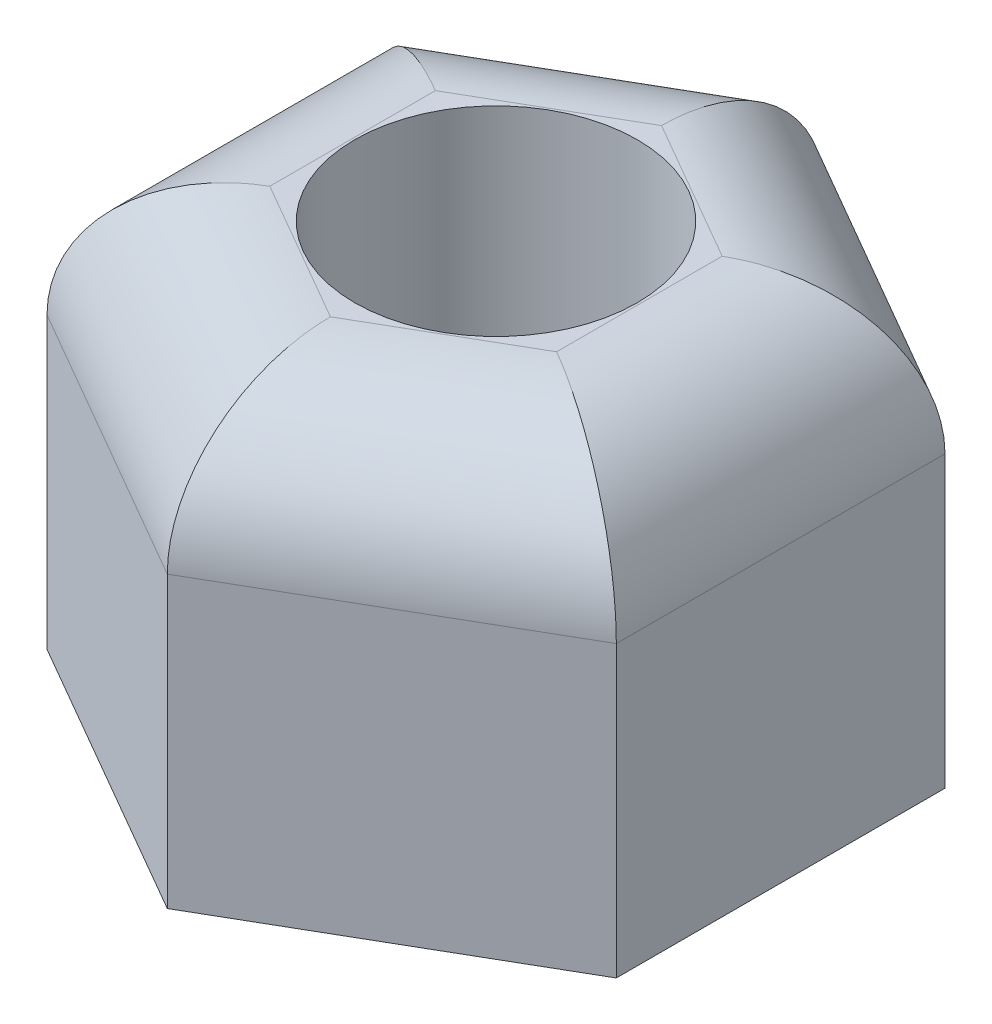
ISO-10303-21;
HEADER;
FILE_DESCRIPTION(('STEP AP214'),'2;1');
FILE_NAME('part.step','',(''),(''),'','','');
FILE_SCHEMA(('AUTOMOTIVE_DESIGN { 1 0 10303 214 1 1 1 1 }'));
ENDSEC;
DATA;
#1=APPLICATION_CONTEXT('core data for automotive mechanical design processes');
#2=APPLICATION_PROTOCOL_DEFINITION('international standard','automotive_design',2000,#1);
#3=PRODUCT_CONTEXT('',#1,'mechanical');
#4=PRODUCT('Part','Part','',(#3));
#5=PRODUCT_RELATED_PRODUCT_CATEGORY('part','',(#4));
#6=PRODUCT_DEFINITION_FORMATION('','',#4);
#7=PRODUCT_DEFINITION_CONTEXT('part definition',#1,'design');
#8=PRODUCT_DEFINITION('design','',#6,#7);
#9=PRODUCT_DEFINITION_SHAPE('','',#8);
#10=(LENGTH_UNIT() NAMED_UNIT(*) SI_UNIT(.MILLI.,.METRE.));
#11=(NAMED_UNIT(*) PLANE_ANGLE_UNIT() SI_UNIT($,.RADIAN.));
#12=(NAMED_UNIT(*) SI_UNIT($,.STERADIAN.) SOLID_ANGLE_UNIT());
#13=UNCERTAINTY_MEASURE_WITH_UNIT(LENGTH_MEASURE(1.E-05),#10,'distance_accuracy_value','');
#14=(GEOMETRIC_REPRESENTATION_CONTEXT(3) GLOBAL_UNCERTAINTY_ASSIGNED_CONTEXT((#13)) GLOBAL_UNIT_ASSIGNED_CONTEXT((#10,
#11,#12)) REPRESENTATION_CONTEXT('',''));
#15=CARTESIAN_POINT('',(0.,0.,0.));
#16=DIRECTION('',(0.,0.,1.));
#17=DIRECTION('',(1.,0.,0.));
#18=AXIS2_PLACEMENT_3D('',#15,#16,#17);
#19=CARTESIAN_POINT('',(0.,3.05,0.));
#20=DIRECTION('',(0.,1.,0.));
#21=DIRECTION('',(0.,0.,1.));
#22=AXIS2_PLACEMENT_3D('',#19,#20,#21);
#23=PLANE('',#22);
#24=DIRECTION('',(-0.866025403784438,0.,0.5));
#25=VECTOR('',#24,1.);
#26=CARTESIAN_POINT('',(-1.515,3.05,-0.297335388632656));
#27=LINE('',#26,#25);
#28=CARTESIAN_POINT('',(0.,3.05,-1.17202104645494));
#29=VERTEX_POINT('',#28);
#30=CARTESIAN_POINT('',(-1.015,3.05,-0.586010523227469));
#31=VERTEX_POINT('',#30);
#32=EDGE_CURVE('E159',#29,#31,#27,.T.);
#33=ORIENTED_EDGE('',*,*,#32,.T.);
#34=DIRECTION('',(0.,0.,1.));
#35=VECTOR('',#34,1.);
#36=CARTESIAN_POINT('',(-1.015,3.05,1.1633607924171));
#37=LINE('',#36,#35);
#38=CARTESIAN_POINT('',(-1.015,3.05,0.586010523227471));
#39=VERTEX_POINT('',#38);
#40=EDGE_CURVE('E161',#31,#39,#37,.T.);
#41=ORIENTED_EDGE('',*,*,#40,.T.);
#42=DIRECTION('',(0.866025403784439,0.,0.5));
#43=VECTOR('',#42,1.);
#44=CARTESIAN_POINT('',(0.500000000000001,3.05,1.46069618104975));
#45=LINE('',#44,#43);
#46=CARTESIAN_POINT('',(0.,3.05,1.17202104645494));
#47=VERTEX_POINT('',#46);
#48=EDGE_CURVE('E112',#39,#47,#45,.T.);
#49=ORIENTED_EDGE('',*,*,#48,.T.);
#50=DIRECTION('',(0.866025403784439,0.,-0.5));
#51=VECTOR('',#50,1.);
#52=CARTESIAN_POINT('',(1.515,3.05,0.297335388632656));
#53=LINE('',#52,#51);
#54=CARTESIAN_POINT('',(1.015,3.05,0.586010523227469));
#55=VERTEX_POINT('',#54);
#56=EDGE_CURVE('E153',#47,#55,#53,.T.);
#57=ORIENTED_EDGE('',*,*,#56,.T.);
#58=DIRECTION('',(0.,0.,-1.));
#59=VECTOR('',#58,1.);
#60=CARTESIAN_POINT('',(1.015,3.05,-1.1633607924171));
#61=LINE('',#60,#59);
#62=CARTESIAN_POINT('',(1.015,3.05,-0.58601052322747));
#63=VERTEX_POINT('',#62);
#64=EDGE_CURVE('E155',#55,#63,#61,.T.);
#65=ORIENTED_EDGE('',*,*,#64,.T.);
#66=DIRECTION('',(-0.866025403784439,0.,-0.5));
#67=VECTOR('',#66,1.);
#68=CARTESIAN_POINT('',(-0.5,3.05,-1.46069618104975));
#69=LINE('',#68,#67);
#70=EDGE_CURVE('E157',#63,#29,#69,.T.);
#71=ORIENTED_EDGE('',*,*,#70,.T.);
#72=EDGE_LOOP('',(#33,#41,#49,#57,#65,#71));
#73=FACE_BOUND('',#72,.T.);
#74=CARTESIAN_POINT('',(0.,3.05,0.));
#75=DIRECTION('',(0.,1.,0.));
#76=DIRECTION('',(0.,0.,1.));
#77=AXIS2_PLACEMENT_3D('',#74,#75,#76);
#78=CIRCLE('',#77,1.);
#79=CARTESIAN_POINT('',(0.,3.05,1.));
#80=VERTEX_POINT('',#79);
#81=EDGE_CURVE('E128',#80,#80,#78,.T.);
#82=ORIENTED_EDGE('',*,*,#81,.F.);
#83=EDGE_LOOP('',(#82));
#84=FACE_BOUND('',#83,.T.);
#85=ADVANCED_FACE('F32',(#73,#84),#23,.T.);
#86=CARTESIAN_POINT('',(0.,0.,0.));
#87=DIRECTION('',(0.,1.,0.));
#88=DIRECTION('',(0.,0.,1.));
#89=AXIS2_PLACEMENT_3D('',#86,#87,#88);
#90=PLANE('',#89);
#91=DIRECTION('',(0.,0.,-1.));
#92=VECTOR('',#91,1.);
#93=CARTESIAN_POINT('',(2.015,0.,1.16336079241709));
#94=LINE('',#93,#92);
#95=CARTESIAN_POINT('',(2.015,0.,1.16336079241709));
#96=VERTEX_POINT('',#95);
#97=CARTESIAN_POINT('',(2.015,0.,-1.1633607924171));
#98=VERTEX_POINT('',#97);
#99=EDGE_CURVE('E120',#96,#98,#94,.T.);
#100=ORIENTED_EDGE('',*,*,#99,.F.);
#101=DIRECTION('',(0.866025403784438,0.,-0.5));
#102=VECTOR('',#101,1.);
#103=CARTESIAN_POINT('',(0.,0.,2.32672158483419));
#104=LINE('',#103,#102);
#105=CARTESIAN_POINT('',(0.,0.,2.32672158483419));
#106=VERTEX_POINT('',#105);
#107=EDGE_CURVE('E142',#106,#96,#104,.T.);
#108=ORIENTED_EDGE('',*,*,#107,.F.);
#109=DIRECTION('',(0.866025403784439,0.,0.5));
#110=VECTOR('',#109,1.);
#111=CARTESIAN_POINT('',(-2.015,0.,1.1633607924171));
#112=LINE('',#111,#110);
#113=CARTESIAN_POINT('',(-2.015,0.,1.1633607924171));
#114=VERTEX_POINT('',#113);
#115=EDGE_CURVE('E139',#114,#106,#112,.T.);
#116=ORIENTED_EDGE('',*,*,#115,.F.);
#117=DIRECTION('',(0.,0.,1.));
#118=VECTOR('',#117,1.);
#119=CARTESIAN_POINT('',(-2.015,0.,-1.1633607924171));
#120=LINE('',#119,#118);
#121=CARTESIAN_POINT('',(-2.015,0.,-1.1633607924171));
#122=VERTEX_POINT('',#121);
#123=EDGE_CURVE('E136',#122,#114,#120,.T.);
#124=ORIENTED_EDGE('',*,*,#123,.F.);
#125=DIRECTION('',(-0.866025403784438,0.,0.5));
#126=VECTOR('',#125,1.);
#127=CARTESIAN_POINT('',(0.,0.,-2.32672158483419));
#128=LINE('',#127,#126);
#129=CARTESIAN_POINT('',(0.,0.,-2.32672158483419));
#130=VERTEX_POINT('',#129);
#131=EDGE_CURVE('E123',#130,#122,#128,.T.);
#132=ORIENTED_EDGE('',*,*,#131,.F.);
#133=DIRECTION('',(-0.866025403784439,0.,-0.5));
#134=VECTOR('',#133,1.);
#135=CARTESIAN_POINT('',(2.015,0.,-1.1633607924171));
#136=LINE('',#135,#134);
#137=EDGE_CURVE('E107',#98,#130,#136,.T.);
#138=ORIENTED_EDGE('',*,*,#137,.F.);
#139=EDGE_LOOP('',(#100,#108,#116,#124,#132,#138));
#140=FACE_BOUND('',#139,.T.);
#141=CARTESIAN_POINT('',(0.,0.,0.));
#142=DIRECTION('',(0.,1.,0.));
#143=DIRECTION('',(0.,0.,1.));
#144=AXIS2_PLACEMENT_3D('',#141,#142,#143);
#145=CIRCLE('',#144,1.);
#146=CARTESIAN_POINT('',(0.,0.,1.));
#147=VERTEX_POINT('',#146);
#148=EDGE_CURVE('E131',#147,#147,#145,.T.);
#149=ORIENTED_EDGE('',*,*,#148,.T.);
#150=EDGE_LOOP('',(#149));
#151=FACE_BOUND('',#150,.T.);
#152=ADVANCED_FACE('F117',(#140,#151),#90,.F.);
#153=CARTESIAN_POINT('',(2.015,3.05,1.16336079241709));
#154=DIRECTION('',(-1.,0.,0.));
#155=DIRECTION('',(0.,0.,1.));
#156=AXIS2_PLACEMENT_3D('',#153,#154,#155);
#157=PLANE('',#156);
#158=DIRECTION('',(0.,-1.,0.));
#159=VECTOR('',#158,1.);
#160=CARTESIAN_POINT('',(2.015,3.05,-1.1633607924171));
#161=LINE('',#160,#159);
#162=CARTESIAN_POINT('',(2.015,2.05,-1.1633607924171));
#163=VERTEX_POINT('',#162);
#164=EDGE_CURVE('E103',#163,#98,#161,.T.);
#165=ORIENTED_EDGE('',*,*,#164,.F.);
#166=DIRECTION('',(0.,0.,-1.));
#167=VECTOR('',#166,1.);
#168=CARTESIAN_POINT('',(2.015,2.05,1.16336079241709));
#169=LINE('',#168,#167);
#170=CARTESIAN_POINT('',(2.015,2.05,1.16336079241709));
#171=VERTEX_POINT('',#170);
#172=EDGE_CURVE('E56',#163,#171,#169,.F.);
#173=ORIENTED_EDGE('',*,*,#172,.T.);
#174=DIRECTION('',(0.,-1.,0.));
#175=VECTOR('',#174,1.);
#176=CARTESIAN_POINT('',(2.015,3.05,1.16336079241709));
#177=LINE('',#176,#175);
#178=EDGE_CURVE('E126',#171,#96,#177,.T.);
#179=ORIENTED_EDGE('',*,*,#178,.T.);
#180=ORIENTED_EDGE('',*,*,#99,.T.);
#181=EDGE_LOOP('',(#165,#173,#179,#180));
#182=FACE_BOUND('',#181,.T.);
#183=ADVANCED_FACE('F125',(#182),#157,.F.);
#184=CARTESIAN_POINT('',(2.015,3.05,-1.1633607924171));
#185=DIRECTION('',(-0.5,0.,0.866025403784439));
#186=DIRECTION('',(0.866025403784439,0.,0.5));
#187=AXIS2_PLACEMENT_3D('',#184,#185,#186);
#188=PLANE('',#187);
#189=DIRECTION('',(0.,-1.,0.));
#190=VECTOR('',#189,1.);
#191=CARTESIAN_POINT('',(0.,3.05,-2.32672158483419));
#192=LINE('',#191,#190);
#193=CARTESIAN_POINT('',(0.,2.05,-2.32672158483419));
#194=VERTEX_POINT('',#193);
#195=EDGE_CURVE('E113',#194,#130,#192,.T.);
#196=ORIENTED_EDGE('',*,*,#195,.F.);
#197=DIRECTION('',(-0.866025403784439,0.,-0.5));
#198=VECTOR('',#197,1.);
#199=CARTESIAN_POINT('',(2.015,2.05,-1.1633607924171));
#200=LINE('',#199,#198);
#201=EDGE_CURVE('E110',#194,#163,#200,.F.);
#202=ORIENTED_EDGE('',*,*,#201,.T.);
#203=ORIENTED_EDGE('',*,*,#164,.T.);
#204=ORIENTED_EDGE('',*,*,#137,.T.);
#205=EDGE_LOOP('',(#196,#202,#203,#204));
#206=FACE_BOUND('',#205,.T.);
#207=ADVANCED_FACE('F106',(#206),#188,.F.);
#208=CARTESIAN_POINT('',(0.,3.05,-2.32672158483419));
#209=DIRECTION('',(0.5,0.,0.866025403784438));
#210=DIRECTION('',(0.866025403784438,0.,-0.5));
#211=AXIS2_PLACEMENT_3D('',#208,#209,#210);
#212=PLANE('',#211);
#213=DIRECTION('',(0.,-1.,0.));
#214=VECTOR('',#213,1.);
#215=CARTESIAN_POINT('',(-2.015,3.05,-1.1633607924171));
#216=LINE('',#215,#214);
#217=CARTESIAN_POINT('',(-2.015,2.05,-1.1633607924171));
#218=VERTEX_POINT('',#217);
#219=EDGE_CURVE('E149',#218,#122,#216,.T.);
#220=ORIENTED_EDGE('',*,*,#219,.F.);
#221=DIRECTION('',(-0.866025403784438,0.,0.5));
#222=VECTOR('',#221,1.);
#223=CARTESIAN_POINT('',(0.,2.05,-2.32672158483419));
#224=LINE('',#223,#222);
#225=EDGE_CURVE('E167',#218,#194,#224,.F.);
#226=ORIENTED_EDGE('',*,*,#225,.T.);
#227=ORIENTED_EDGE('',*,*,#195,.T.);
#228=ORIENTED_EDGE('',*,*,#131,.T.);
#229=EDGE_LOOP('',(#220,#226,#227,#228));
#230=FACE_BOUND('',#229,.T.);
#231=ADVANCED_FACE('F221',(#230),#212,.F.);
#232=CARTESIAN_POINT('',(-2.015,3.05,-1.1633607924171));
#233=DIRECTION('',(1.,0.,0.));
#234=DIRECTION('',(0.,0.,-1.));
#235=AXIS2_PLACEMENT_3D('',#232,#233,#234);
#236=PLANE('',#235);
#237=DIRECTION('',(0.,-1.,0.));
#238=VECTOR('',#237,1.);
#239=CARTESIAN_POINT('',(-2.015,3.05,1.1633607924171));
#240=LINE('',#239,#238);
#241=CARTESIAN_POINT('',(-2.015,2.05,1.1633607924171));
#242=VERTEX_POINT('',#241);
#243=EDGE_CURVE('E147',#242,#114,#240,.T.);
#244=ORIENTED_EDGE('',*,*,#243,.F.);
#245=DIRECTION('',(0.,0.,1.));
#246=VECTOR('',#245,1.);
#247=CARTESIAN_POINT('',(-2.015,2.05,-1.1633607924171));
#248=LINE('',#247,#246);
#249=EDGE_CURVE('E164',#242,#218,#248,.F.);
#250=ORIENTED_EDGE('',*,*,#249,.T.);
#251=ORIENTED_EDGE('',*,*,#219,.T.);
#252=ORIENTED_EDGE('',*,*,#123,.T.);
#253=EDGE_LOOP('',(#244,#250,#251,#252));
#254=FACE_BOUND('',#253,.T.);
#255=ADVANCED_FACE('F217',(#254),#236,.F.);
#256=CARTESIAN_POINT('',(-2.015,3.05,1.1633607924171));
#257=DIRECTION('',(0.5,0.,-0.866025403784439));
#258=DIRECTION('',(-0.866025403784439,0.,-0.5));
#259=AXIS2_PLACEMENT_3D('',#256,#257,#258);
#260=PLANE('',#259);
#261=DIRECTION('',(0.,-1.,0.));
#262=VECTOR('',#261,1.);
#263=CARTESIAN_POINT('',(0.,3.05,2.32672158483419));
#264=LINE('',#263,#262);
#265=CARTESIAN_POINT('',(0.,2.05,2.32672158483419));
#266=VERTEX_POINT('',#265);
#267=EDGE_CURVE('E145',#266,#106,#264,.T.);
#268=ORIENTED_EDGE('',*,*,#267,.F.);
#269=DIRECTION('',(0.866025403784439,0.,0.5));
#270=VECTOR('',#269,1.);
#271=CARTESIAN_POINT('',(-2.015,2.05,1.1633607924171));
#272=LINE('',#271,#270);
#273=EDGE_CURVE('E11',#266,#242,#272,.F.);
#274=ORIENTED_EDGE('',*,*,#273,.T.);
#275=ORIENTED_EDGE('',*,*,#243,.T.);
#276=ORIENTED_EDGE('',*,*,#115,.T.);
#277=EDGE_LOOP('',(#268,#274,#275,#276));
#278=FACE_BOUND('',#277,.T.);
#279=ADVANCED_FACE('F204',(#278),#260,.F.);
#280=CARTESIAN_POINT('',(0.,3.05,2.32672158483419));
#281=DIRECTION('',(-0.5,0.,-0.866025403784439));
#282=DIRECTION('',(-0.866025403784439,0.,0.5));
#283=AXIS2_PLACEMENT_3D('',#280,#281,#282);
#284=PLANE('',#283);
#285=ORIENTED_EDGE('',*,*,#178,.F.);
#286=DIRECTION('',(0.866025403784439,0.,-0.5));
#287=VECTOR('',#286,1.);
#288=CARTESIAN_POINT('',(0.,2.05,2.32672158483419));
#289=LINE('',#288,#287);
#290=EDGE_CURVE('E41',#171,#266,#289,.F.);
#291=ORIENTED_EDGE('',*,*,#290,.T.);
#292=ORIENTED_EDGE('',*,*,#267,.T.);
#293=ORIENTED_EDGE('',*,*,#107,.T.);
#294=EDGE_LOOP('',(#285,#291,#292,#293));
#295=FACE_BOUND('',#294,.T.);
#296=ADVANCED_FACE('F195',(#295),#284,.F.);
#297=CARTESIAN_POINT('',(0.,3.05,0.));
#298=DIRECTION('',(0.,-1.,0.));
#299=DIRECTION('',(0.,0.,-1.));
#300=AXIS2_PLACEMENT_3D('',#297,#298,#299);
#301=CYLINDRICAL_SURFACE('',#300,1.);
#302=ORIENTED_EDGE('',*,*,#81,.T.);
#303=EDGE_LOOP('',(#302));
#304=FACE_BOUND('',#303,.T.);
#305=ORIENTED_EDGE('',*,*,#148,.F.);
#306=EDGE_LOOP('',(#305));
#307=FACE_BOUND('',#306,.T.);
#308=ADVANCED_FACE('F193',(#304,#307),#301,.F.);
#309=CARTESIAN_POINT('',(1.015,2.05,0.));
#310=DIRECTION('',(0.,0.,1.));
#311=DIRECTION('',(1.,0.,0.));
#312=AXIS2_PLACEMENT_3D('',#309,#310,#311);
#313=CYLINDRICAL_SURFACE('',#312,1.);
#314=CARTESIAN_POINT('',(1.015,2.05,0.586010523227469));
#315=DIRECTION('',(-0.5,0.,0.866025403784439));
#316=DIRECTION('',(-0.866025403784439,0.,-0.5));
#317=AXIS2_PLACEMENT_3D('',#314,#315,#316);
#318=ELLIPSE('',#317,1.15470053837925,1.);
#319=EDGE_CURVE('E181',#171,#55,#318,.T.);
#320=ORIENTED_EDGE('',*,*,#319,.F.);
#321=ORIENTED_EDGE('',*,*,#172,.F.);
#322=CARTESIAN_POINT('',(1.015,2.05,-0.58601052322747));
#323=DIRECTION('',(0.5,0.,0.866025403784438));
#324=DIRECTION('',(-0.866025403784439,0.,0.5));
#325=AXIS2_PLACEMENT_3D('',#322,#323,#324);
#326=ELLIPSE('',#325,1.15470053837925,1.);
#327=EDGE_CURVE('E36',#63,#163,#326,.F.);
#328=ORIENTED_EDGE('',*,*,#327,.F.);
#329=ORIENTED_EDGE('',*,*,#64,.F.);
#330=EDGE_LOOP('',(#320,#321,#328,#329));
#331=FACE_BOUND('',#330,.T.);
#332=ADVANCED_FACE('F34',(#331),#313,.T.);
#333=CARTESIAN_POINT('',(0.5075,2.05,-0.879015784841205));
#334=DIRECTION('',(0.866025403784439,0.,0.5));
#335=DIRECTION('',(0.5,0.,-0.866025403784439));
#336=AXIS2_PLACEMENT_3D('',#333,#334,#335);
#337=CYLINDRICAL_SURFACE('',#336,1.);
#338=ORIENTED_EDGE('',*,*,#327,.T.);
#339=ORIENTED_EDGE('',*,*,#201,.F.);
#340=CARTESIAN_POINT('',(0.,2.05,-1.17202104645494));
#341=DIRECTION('',(1.,0.,0.));
#342=DIRECTION('',(0.,0.,1.));
#343=AXIS2_PLACEMENT_3D('',#340,#341,#342);
#344=ELLIPSE('',#343,1.15470053837925,1.);
#345=EDGE_CURVE('E179',#29,#194,#344,.F.);
#346=ORIENTED_EDGE('',*,*,#345,.F.);
#347=ORIENTED_EDGE('',*,*,#70,.F.);
#348=EDGE_LOOP('',(#338,#339,#346,#347));
#349=FACE_BOUND('',#348,.T.);
#350=ADVANCED_FACE('F202',(#349),#337,.T.);
#351=CARTESIAN_POINT('',(0.5075,2.05,0.879015784841205));
#352=DIRECTION('',(-0.866025403784439,0.,0.5));
#353=DIRECTION('',(0.5,0.,0.866025403784439));
#354=AXIS2_PLACEMENT_3D('',#351,#352,#353);
#355=CYLINDRICAL_SURFACE('',#354,1.);
#356=ORIENTED_EDGE('',*,*,#319,.T.);
#357=ORIENTED_EDGE('',*,*,#56,.F.);
#358=CARTESIAN_POINT('',(0.,2.05,1.17202104645494));
#359=DIRECTION('',(-1.,0.,0.));
#360=DIRECTION('',(0.,0.,-1.));
#361=AXIS2_PLACEMENT_3D('',#358,#359,#360);
#362=ELLIPSE('',#361,1.15470053837925,1.);
#363=EDGE_CURVE('E176',#266,#47,#362,.T.);
#364=ORIENTED_EDGE('',*,*,#363,.F.);
#365=ORIENTED_EDGE('',*,*,#290,.F.);
#366=EDGE_LOOP('',(#356,#357,#364,#365));
#367=FACE_BOUND('',#366,.T.);
#368=ADVANCED_FACE('F241',(#367),#355,.T.);
#369=CARTESIAN_POINT('',(-0.5075,2.05,-0.879015784841205));
#370=DIRECTION('',(0.866025403784438,0.,-0.5));
#371=DIRECTION('',(-0.5,0.,-0.866025403784438));
#372=AXIS2_PLACEMENT_3D('',#369,#370,#371);
#373=CYLINDRICAL_SURFACE('',#372,1.);
#374=ORIENTED_EDGE('',*,*,#345,.T.);
#375=ORIENTED_EDGE('',*,*,#225,.F.);
#376=CARTESIAN_POINT('',(-1.015,2.05,-0.586010523227469));
#377=DIRECTION('',(0.5,0.,-0.866025403784439));
#378=DIRECTION('',(0.866025403784439,0.,0.5));
#379=AXIS2_PLACEMENT_3D('',#376,#377,#378);
#380=ELLIPSE('',#379,1.15470053837925,1.);
#381=EDGE_CURVE('E174',#31,#218,#380,.F.);
#382=ORIENTED_EDGE('',*,*,#381,.F.);
#383=ORIENTED_EDGE('',*,*,#32,.F.);
#384=EDGE_LOOP('',(#374,#375,#382,#383));
#385=FACE_BOUND('',#384,.T.);
#386=ADVANCED_FACE('F237',(#385),#373,.T.);
#387=CARTESIAN_POINT('',(-0.5075,2.05,0.879015784841205));
#388=DIRECTION('',(-0.866025403784439,0.,-0.5));
#389=DIRECTION('',(-0.5,0.,0.866025403784439));
#390=AXIS2_PLACEMENT_3D('',#387,#388,#389);
#391=CYLINDRICAL_SURFACE('',#390,1.);
#392=ORIENTED_EDGE('',*,*,#363,.T.);
#393=ORIENTED_EDGE('',*,*,#48,.F.);
#394=CARTESIAN_POINT('',(-1.015,2.05,0.586010523227471));
#395=DIRECTION('',(-0.5,0.,-0.866025403784438));
#396=DIRECTION('',(-0.866025403784439,0.,0.5));
#397=AXIS2_PLACEMENT_3D('',#394,#395,#396);
#398=ELLIPSE('',#397,1.15470053837925,1.);
#399=EDGE_CURVE('E172',#242,#39,#398,.T.);
#400=ORIENTED_EDGE('',*,*,#399,.F.);
#401=ORIENTED_EDGE('',*,*,#273,.F.);
#402=EDGE_LOOP('',(#392,#393,#400,#401));
#403=FACE_BOUND('',#402,.T.);
#404=ADVANCED_FACE('F233',(#403),#391,.T.);
#405=CARTESIAN_POINT('',(-1.015,2.05,0.));
#406=DIRECTION('',(0.,0.,-1.));
#407=DIRECTION('',(-1.,0.,0.));
#408=AXIS2_PLACEMENT_3D('',#405,#406,#407);
#409=CYLINDRICAL_SURFACE('',#408,1.);
#410=ORIENTED_EDGE('',*,*,#381,.T.);
#411=ORIENTED_EDGE('',*,*,#249,.F.);
#412=ORIENTED_EDGE('',*,*,#399,.T.);
#413=ORIENTED_EDGE('',*,*,#40,.F.);
#414=EDGE_LOOP('',(#410,#411,#412,#413));
#415=FACE_BOUND('',#414,.T.);
#416=ADVANCED_FACE('F230',(#415),#409,.T.);
#417=CLOSED_SHELL('',(#85,#152,#183,#207,#231,#255,#279,#296,#308,#332,#350,#368,#386,#404,#416));
#418=MANIFOLD_SOLID_BREP('B2',#417);
#419=ADVANCED_BREP_SHAPE_REPRESENTATION('',(#18,#418),#14);
#420=SHAPE_DEFINITION_REPRESENTATION(#9,#419);
ENDSEC;
END-ISO-10303-21;
